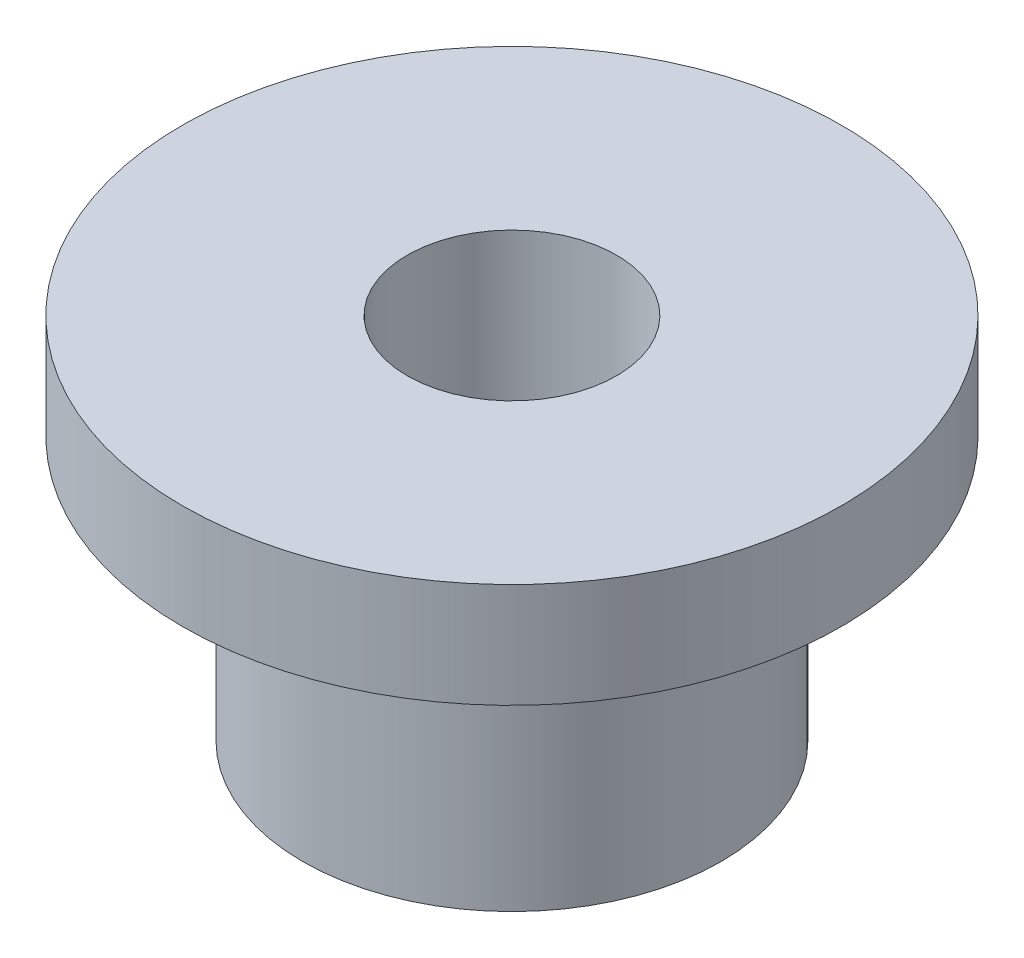
ISO-10303-21;
HEADER;
FILE_DESCRIPTION(('STEP AP214'),'2;1');
FILE_NAME('part.step','',(''),(''),'','','');
FILE_SCHEMA(('AUTOMOTIVE_DESIGN { 1 0 10303 214 1 1 1 1 }'));
ENDSEC;
DATA;
#1=APPLICATION_CONTEXT('core data for automotive mechanical design processes');
#2=APPLICATION_PROTOCOL_DEFINITION('international standard','automotive_design',2000,#1);
#3=PRODUCT_CONTEXT('',#1,'mechanical');
#4=PRODUCT('Part','Part','',(#3));
#5=PRODUCT_RELATED_PRODUCT_CATEGORY('part','',(#4));
#6=PRODUCT_DEFINITION_FORMATION('','',#4);
#7=PRODUCT_DEFINITION_CONTEXT('part definition',#1,'design');
#8=PRODUCT_DEFINITION('design','',#6,#7);
#9=PRODUCT_DEFINITION_SHAPE('','',#8);
#10=(LENGTH_UNIT() NAMED_UNIT(*) SI_UNIT(.MILLI.,.METRE.));
#11=(NAMED_UNIT(*) PLANE_ANGLE_UNIT() SI_UNIT($,.RADIAN.));
#12=(NAMED_UNIT(*) SI_UNIT($,.STERADIAN.) SOLID_ANGLE_UNIT());
#13=UNCERTAINTY_MEASURE_WITH_UNIT(LENGTH_MEASURE(1.E-05),#10,'distance_accuracy_value','');
#14=(GEOMETRIC_REPRESENTATION_CONTEXT(3) GLOBAL_UNCERTAINTY_ASSIGNED_CONTEXT((#13)) GLOBAL_UNIT_ASSIGNED_CONTEXT((#10,
#11,#12)) REPRESENTATION_CONTEXT('',''));
#15=CARTESIAN_POINT('',(0.,0.,0.));
#16=DIRECTION('',(0.,0.,1.));
#17=DIRECTION('',(1.,0.,0.));
#18=AXIS2_PLACEMENT_3D('',#15,#16,#17);
#19=CARTESIAN_POINT('',(0.,0.,0.));
#20=DIRECTION('',(0.,1.,0.));
#21=DIRECTION('',(0.,0.,1.));
#22=AXIS2_PLACEMENT_3D('',#19,#20,#21);
#23=PLANE('',#22);
#24=CARTESIAN_POINT('',(0.,0.,0.));
#25=DIRECTION('',(0.,1.,0.));
#26=DIRECTION('',(0.,0.,1.));
#27=AXIS2_PLACEMENT_3D('',#24,#25,#26);
#28=CIRCLE('',#27,6.35);
#29=CARTESIAN_POINT('',(0.,0.,6.35));
#30=VERTEX_POINT('',#29);
#31=EDGE_CURVE('E41',#30,#30,#28,.T.);
#32=ORIENTED_EDGE('',*,*,#31,.F.);
#33=EDGE_LOOP('',(#32));
#34=FACE_BOUND('',#33,.T.);
#35=CARTESIAN_POINT('',(0.,0.,0.));
#36=DIRECTION('',(0.,1.,0.));
#37=DIRECTION('',(0.,0.,1.));
#38=AXIS2_PLACEMENT_3D('',#35,#36,#37);
#39=CIRCLE('',#38,3.175);
#40=CARTESIAN_POINT('',(0.,0.,3.175));
#41=VERTEX_POINT('',#40);
#42=EDGE_CURVE('E48',#41,#41,#39,.T.);
#43=ORIENTED_EDGE('',*,*,#42,.T.);
#44=EDGE_LOOP('',(#43));
#45=FACE_BOUND('',#44,.T.);
#46=ADVANCED_FACE('F37',(#34,#45),#23,.F.);
#47=CARTESIAN_POINT('',(0.,8.,0.));
#48=DIRECTION('',(0.,-1.,0.));
#49=DIRECTION('',(0.,0.,-1.));
#50=AXIS2_PLACEMENT_3D('',#47,#48,#49);
#51=CYLINDRICAL_SURFACE('',#50,6.35);
#52=CARTESIAN_POINT('',(0.,8.,0.));
#53=DIRECTION('',(0.,1.,0.));
#54=DIRECTION('',(0.,0.,1.));
#55=AXIS2_PLACEMENT_3D('',#52,#53,#54);
#56=CIRCLE('',#55,6.35);
#57=CARTESIAN_POINT('',(0.,8.,6.35));
#58=VERTEX_POINT('',#57);
#59=EDGE_CURVE('E10',#58,#58,#56,.T.);
#60=ORIENTED_EDGE('',*,*,#59,.F.);
#61=EDGE_LOOP('',(#60));
#62=FACE_BOUND('',#61,.T.);
#63=ORIENTED_EDGE('',*,*,#31,.T.);
#64=EDGE_LOOP('',(#63));
#65=FACE_BOUND('',#64,.T.);
#66=ADVANCED_FACE('F39',(#62,#65),#51,.T.);
#67=CARTESIAN_POINT('',(0.,8.,0.));
#68=DIRECTION('',(0.,-1.,0.));
#69=DIRECTION('',(0.,0.,-1.));
#70=AXIS2_PLACEMENT_3D('',#67,#68,#69);
#71=CYLINDRICAL_SURFACE('',#70,3.175);
#72=ORIENTED_EDGE('',*,*,#42,.F.);
#73=EDGE_LOOP('',(#72));
#74=FACE_BOUND('',#73,.T.);
#75=CARTESIAN_POINT('',(0.,11.175,0.));
#76=DIRECTION('',(0.,1.,0.));
#77=DIRECTION('',(0.,0.,1.));
#78=AXIS2_PLACEMENT_3D('',#75,#76,#77);
#79=CIRCLE('',#78,3.175);
#80=CARTESIAN_POINT('',(0.,11.175,3.175));
#81=VERTEX_POINT('',#80);
#82=EDGE_CURVE('E56',#81,#81,#79,.T.);
#83=ORIENTED_EDGE('',*,*,#82,.T.);
#84=EDGE_LOOP('',(#83));
#85=FACE_BOUND('',#84,.T.);
#86=ADVANCED_FACE('F62',(#74,#85),#71,.F.);
#87=CARTESIAN_POINT('',(0.,11.175,0.));
#88=DIRECTION('',(0.,1.,0.));
#89=DIRECTION('',(0.,0.,1.));
#90=AXIS2_PLACEMENT_3D('',#87,#88,#89);
#91=PLANE('',#90);
#92=CARTESIAN_POINT('',(0.,11.175,0.));
#93=DIRECTION('',(0.,1.,0.));
#94=DIRECTION('',(0.,0.,1.));
#95=AXIS2_PLACEMENT_3D('',#92,#93,#94);
#96=CIRCLE('',#95,10.);
#97=CARTESIAN_POINT('',(0.,11.175,10.));
#98=VERTEX_POINT('',#97);
#99=EDGE_CURVE('E52',#98,#98,#96,.T.);
#100=ORIENTED_EDGE('',*,*,#99,.T.);
#101=EDGE_LOOP('',(#100));
#102=FACE_BOUND('',#101,.T.);
#103=ORIENTED_EDGE('',*,*,#82,.F.);
#104=EDGE_LOOP('',(#103));
#105=FACE_BOUND('',#104,.T.);
#106=ADVANCED_FACE('F64',(#102,#105),#91,.T.);
#107=CARTESIAN_POINT('',(0.,8.,0.));
#108=DIRECTION('',(0.,1.,0.));
#109=DIRECTION('',(0.,0.,1.));
#110=AXIS2_PLACEMENT_3D('',#107,#108,#109);
#111=PLANE('',#110);
#112=ORIENTED_EDGE('',*,*,#59,.T.);
#113=EDGE_LOOP('',(#112));
#114=FACE_BOUND('',#113,.T.);
#115=CARTESIAN_POINT('',(0.,8.,0.));
#116=DIRECTION('',(0.,1.,0.));
#117=DIRECTION('',(0.,0.,1.));
#118=AXIS2_PLACEMENT_3D('',#115,#116,#117);
#119=CIRCLE('',#118,10.);
#120=CARTESIAN_POINT('',(0.,8.,10.));
#121=VERTEX_POINT('',#120);
#122=EDGE_CURVE('E53',#121,#121,#119,.T.);
#123=ORIENTED_EDGE('',*,*,#122,.F.);
#124=EDGE_LOOP('',(#123));
#125=FACE_BOUND('',#124,.T.);
#126=ADVANCED_FACE('F66',(#114,#125),#111,.F.);
#127=CARTESIAN_POINT('',(0.,11.175,0.));
#128=DIRECTION('',(0.,-1.,0.));
#129=DIRECTION('',(0.,0.,-1.));
#130=AXIS2_PLACEMENT_3D('',#127,#128,#129);
#131=CYLINDRICAL_SURFACE('',#130,10.);
#132=ORIENTED_EDGE('',*,*,#99,.F.);
#133=EDGE_LOOP('',(#132));
#134=FACE_BOUND('',#133,.T.);
#135=ORIENTED_EDGE('',*,*,#122,.T.);
#136=EDGE_LOOP('',(#135));
#137=FACE_BOUND('',#136,.T.);
#138=ADVANCED_FACE('F73',(#134,#137),#131,.T.);
#139=CLOSED_SHELL('',(#46,#66,#86,#106,#126,#138));
#140=MANIFOLD_SOLID_BREP('B2',#139);
#141=ADVANCED_BREP_SHAPE_REPRESENTATION('',(#18,#140),#14);
#142=SHAPE_DEFINITION_REPRESENTATION(#9,#141);
ENDSEC;
END-ISO-10303-21;
